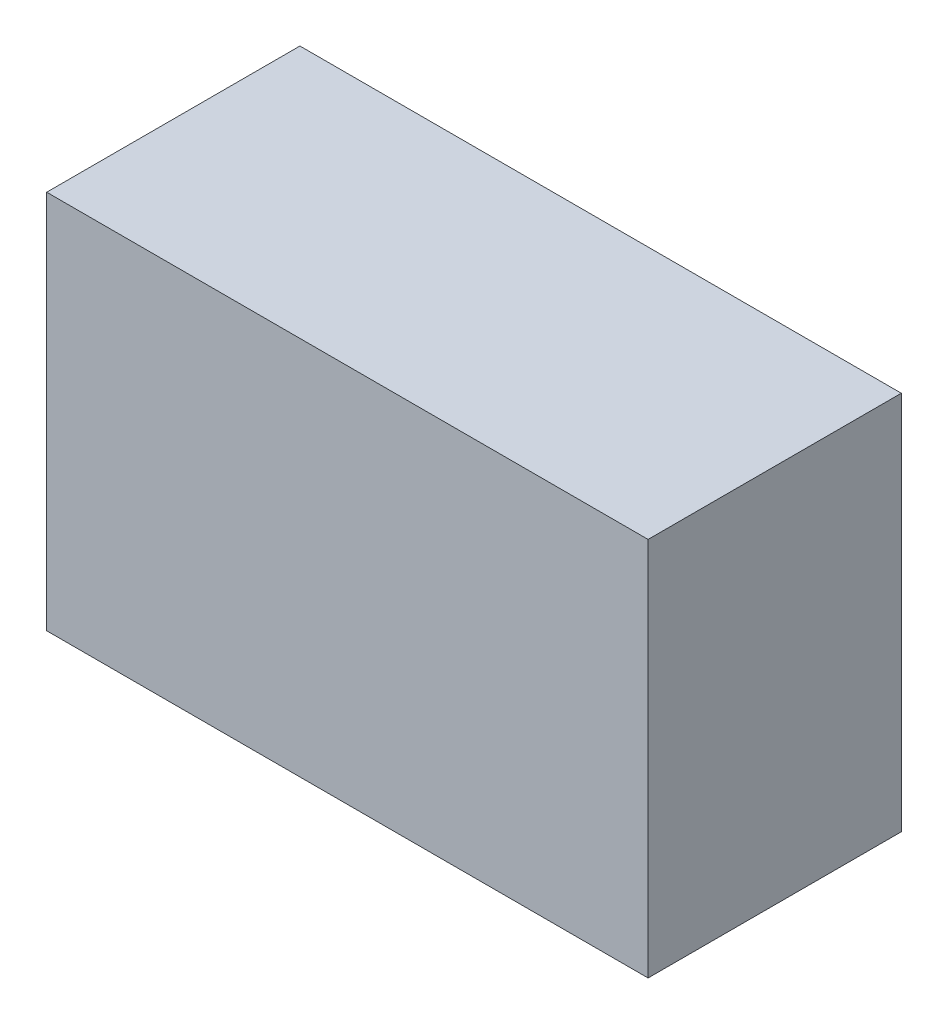
ISO-10303-21;
HEADER;
FILE_DESCRIPTION(('STEP AP214'),'2;1');
FILE_NAME('part.step','',(''),(''),'','','');
FILE_SCHEMA(('AUTOMOTIVE_DESIGN { 1 0 10303 214 1 1 1 1 }'));
ENDSEC;
DATA;
#1=APPLICATION_CONTEXT('core data for automotive mechanical design processes');
#2=APPLICATION_PROTOCOL_DEFINITION('international standard','automotive_design',2000,#1);
#3=PRODUCT_CONTEXT('',#1,'mechanical');
#4=PRODUCT('Part','Part','',(#3));
#5=PRODUCT_RELATED_PRODUCT_CATEGORY('part','',(#4));
#6=PRODUCT_DEFINITION_FORMATION('','',#4);
#7=PRODUCT_DEFINITION_CONTEXT('part definition',#1,'design');
#8=PRODUCT_DEFINITION('design','',#6,#7);
#9=PRODUCT_DEFINITION_SHAPE('','',#8);
#10=(LENGTH_UNIT() NAMED_UNIT(*) SI_UNIT(.MILLI.,.METRE.));
#11=(NAMED_UNIT(*) PLANE_ANGLE_UNIT() SI_UNIT($,.RADIAN.));
#12=(NAMED_UNIT(*) SI_UNIT($,.STERADIAN.) SOLID_ANGLE_UNIT());
#13=UNCERTAINTY_MEASURE_WITH_UNIT(LENGTH_MEASURE(1.E-05),#10,'distance_accuracy_value','');
#14=(GEOMETRIC_REPRESENTATION_CONTEXT(3) GLOBAL_UNCERTAINTY_ASSIGNED_CONTEXT((#13)) GLOBAL_UNIT_ASSIGNED_CONTEXT((#10,
#11,#12)) REPRESENTATION_CONTEXT('',''));
#15=CARTESIAN_POINT('',(0.,0.,0.));
#16=DIRECTION('',(0.,0.,1.));
#17=DIRECTION('',(1.,0.,0.));
#18=AXIS2_PLACEMENT_3D('',#15,#16,#17);
#19=CARTESIAN_POINT('',(0.,0.,0.2));
#20=DIRECTION('',(0.,0.,1.));
#21=DIRECTION('',(1.,0.,0.));
#22=AXIS2_PLACEMENT_3D('',#19,#20,#21);
#23=PLANE('',#22);
#24=DIRECTION('',(0.,1.,0.));
#25=VECTOR('',#24,1.);
#26=CARTESIAN_POINT('',(0.475,0.,0.2));
#27=LINE('',#26,#25);
#28=CARTESIAN_POINT('',(0.475,0.3,0.2));
#29=VERTEX_POINT('',#28);
#30=CARTESIAN_POINT('',(0.475,0.,0.2));
#31=VERTEX_POINT('',#30);
#32=EDGE_CURVE('E76',#29,#31,#27,.F.);
#33=ORIENTED_EDGE('',*,*,#32,.F.);
#34=DIRECTION('',(1.,0.,0.));
#35=VECTOR('',#34,1.);
#36=CARTESIAN_POINT('',(0.,0.3,0.2));
#37=LINE('',#36,#35);
#38=CARTESIAN_POINT('',(0.,0.3,0.2));
#39=VERTEX_POINT('',#38);
#40=EDGE_CURVE('E58',#39,#29,#37,.T.);
#41=ORIENTED_EDGE('',*,*,#40,.F.);
#42=DIRECTION('',(0.,1.,0.));
#43=VECTOR('',#42,1.);
#44=CARTESIAN_POINT('',(0.,0.,0.2));
#45=LINE('',#44,#43);
#46=CARTESIAN_POINT('',(0.,0.,0.2));
#47=VERTEX_POINT('',#46);
#48=EDGE_CURVE('E20',#39,#47,#45,.F.);
#49=ORIENTED_EDGE('',*,*,#48,.T.);
#50=DIRECTION('',(1.,0.,0.));
#51=VECTOR('',#50,1.);
#52=CARTESIAN_POINT('',(0.,0.,0.2));
#53=LINE('',#52,#51);
#54=EDGE_CURVE('E55',#47,#31,#53,.T.);
#55=ORIENTED_EDGE('',*,*,#54,.T.);
#56=EDGE_LOOP('',(#33,#41,#49,#55));
#57=FACE_BOUND('',#56,.T.);
#58=ADVANCED_FACE('F17',(#57),#23,.T.);
#59=CARTESIAN_POINT('',(0.,0.,0.));
#60=DIRECTION('',(1.,0.,0.));
#61=DIRECTION('',(0.,0.,-1.));
#62=AXIS2_PLACEMENT_3D('',#59,#60,#61);
#63=PLANE('',#62);
#64=DIRECTION('',(0.,0.,1.));
#65=VECTOR('',#64,1.);
#66=CARTESIAN_POINT('',(0.,0.3,0.));
#67=LINE('',#66,#65);
#68=CARTESIAN_POINT('',(0.,0.3,0.));
#69=VERTEX_POINT('',#68);
#70=EDGE_CURVE('E78',#69,#39,#67,.T.);
#71=ORIENTED_EDGE('',*,*,#70,.F.);
#72=DIRECTION('',(0.,1.,0.));
#73=VECTOR('',#72,1.);
#74=CARTESIAN_POINT('',(0.,0.,0.));
#75=LINE('',#74,#73);
#76=CARTESIAN_POINT('',(0.,0.,0.));
#77=VERTEX_POINT('',#76);
#78=EDGE_CURVE('E73',#69,#77,#75,.F.);
#79=ORIENTED_EDGE('',*,*,#78,.T.);
#80=DIRECTION('',(0.,0.,1.));
#81=VECTOR('',#80,1.);
#82=CARTESIAN_POINT('',(0.,0.,0.));
#83=LINE('',#82,#81);
#84=EDGE_CURVE('E63',#77,#47,#83,.T.);
#85=ORIENTED_EDGE('',*,*,#84,.T.);
#86=ORIENTED_EDGE('',*,*,#48,.F.);
#87=EDGE_LOOP('',(#71,#79,#85,#86));
#88=FACE_BOUND('',#87,.T.);
#89=ADVANCED_FACE('F72',(#88),#63,.F.);
#90=CARTESIAN_POINT('',(0.,0.,0.));
#91=DIRECTION('',(0.,1.,0.));
#92=DIRECTION('',(0.,0.,1.));
#93=AXIS2_PLACEMENT_3D('',#90,#91,#92);
#94=PLANE('',#93);
#95=ORIENTED_EDGE('',*,*,#54,.F.);
#96=ORIENTED_EDGE('',*,*,#84,.F.);
#97=DIRECTION('',(1.,0.,0.));
#98=VECTOR('',#97,1.);
#99=CARTESIAN_POINT('',(0.,0.,0.));
#100=LINE('',#99,#98);
#101=CARTESIAN_POINT('',(0.475,0.,0.));
#102=VERTEX_POINT('',#101);
#103=EDGE_CURVE('E83',#77,#102,#100,.T.);
#104=ORIENTED_EDGE('',*,*,#103,.T.);
#105=DIRECTION('',(0.,0.,-1.));
#106=VECTOR('',#105,1.);
#107=CARTESIAN_POINT('',(0.475,0.,0.));
#108=LINE('',#107,#106);
#109=EDGE_CURVE('E69',#31,#102,#108,.T.);
#110=ORIENTED_EDGE('',*,*,#109,.F.);
#111=EDGE_LOOP('',(#95,#96,#104,#110));
#112=FACE_BOUND('',#111,.T.);
#113=ADVANCED_FACE('F66',(#112),#94,.F.);
#114=CARTESIAN_POINT('',(0.475,0.,0.));
#115=DIRECTION('',(1.,0.,0.));
#116=DIRECTION('',(0.,0.,-1.));
#117=AXIS2_PLACEMENT_3D('',#114,#115,#116);
#118=PLANE('',#117);
#119=DIRECTION('',(0.,0.,1.));
#120=VECTOR('',#119,1.);
#121=CARTESIAN_POINT('',(0.475,0.3,0.));
#122=LINE('',#121,#120);
#123=CARTESIAN_POINT('',(0.475,0.3,0.));
#124=VERTEX_POINT('',#123);
#125=EDGE_CURVE('E34',#29,#124,#122,.F.);
#126=ORIENTED_EDGE('',*,*,#125,.F.);
#127=ORIENTED_EDGE('',*,*,#32,.T.);
#128=ORIENTED_EDGE('',*,*,#109,.T.);
#129=DIRECTION('',(0.,1.,0.));
#130=VECTOR('',#129,1.);
#131=CARTESIAN_POINT('',(0.475,0.,0.));
#132=LINE('',#131,#130);
#133=EDGE_CURVE('E26',#102,#124,#132,.T.);
#134=ORIENTED_EDGE('',*,*,#133,.T.);
#135=EDGE_LOOP('',(#126,#127,#128,#134));
#136=FACE_BOUND('',#135,.T.);
#137=ADVANCED_FACE('F88',(#136),#118,.T.);
#138=CARTESIAN_POINT('',(0.,0.3,0.));
#139=DIRECTION('',(0.,1.,0.));
#140=DIRECTION('',(0.,0.,1.));
#141=AXIS2_PLACEMENT_3D('',#138,#139,#140);
#142=PLANE('',#141);
#143=ORIENTED_EDGE('',*,*,#40,.T.);
#144=ORIENTED_EDGE('',*,*,#125,.T.);
#145=DIRECTION('',(1.,0.,0.));
#146=VECTOR('',#145,1.);
#147=CARTESIAN_POINT('',(0.,0.3,0.));
#148=LINE('',#147,#146);
#149=EDGE_CURVE('E11',#124,#69,#148,.F.);
#150=ORIENTED_EDGE('',*,*,#149,.T.);
#151=ORIENTED_EDGE('',*,*,#70,.T.);
#152=EDGE_LOOP('',(#143,#144,#150,#151));
#153=FACE_BOUND('',#152,.T.);
#154=ADVANCED_FACE('F91',(#153),#142,.T.);
#155=CARTESIAN_POINT('',(0.,0.,0.));
#156=DIRECTION('',(0.,0.,1.));
#157=DIRECTION('',(1.,0.,0.));
#158=AXIS2_PLACEMENT_3D('',#155,#156,#157);
#159=PLANE('',#158);
#160=ORIENTED_EDGE('',*,*,#133,.F.);
#161=ORIENTED_EDGE('',*,*,#103,.F.);
#162=ORIENTED_EDGE('',*,*,#78,.F.);
#163=ORIENTED_EDGE('',*,*,#149,.F.);
#164=EDGE_LOOP('',(#160,#161,#162,#163));
#165=FACE_BOUND('',#164,.T.);
#166=ADVANCED_FACE('F90',(#165),#159,.F.);
#167=CLOSED_SHELL('',(#58,#89,#113,#137,#154,#166));
#168=MANIFOLD_SOLID_BREP('B1',#167);
#169=ADVANCED_BREP_SHAPE_REPRESENTATION('',(#18,#168),#14);
#170=SHAPE_DEFINITION_REPRESENTATION(#9,#169);
ENDSEC;
END-ISO-10303-21;
